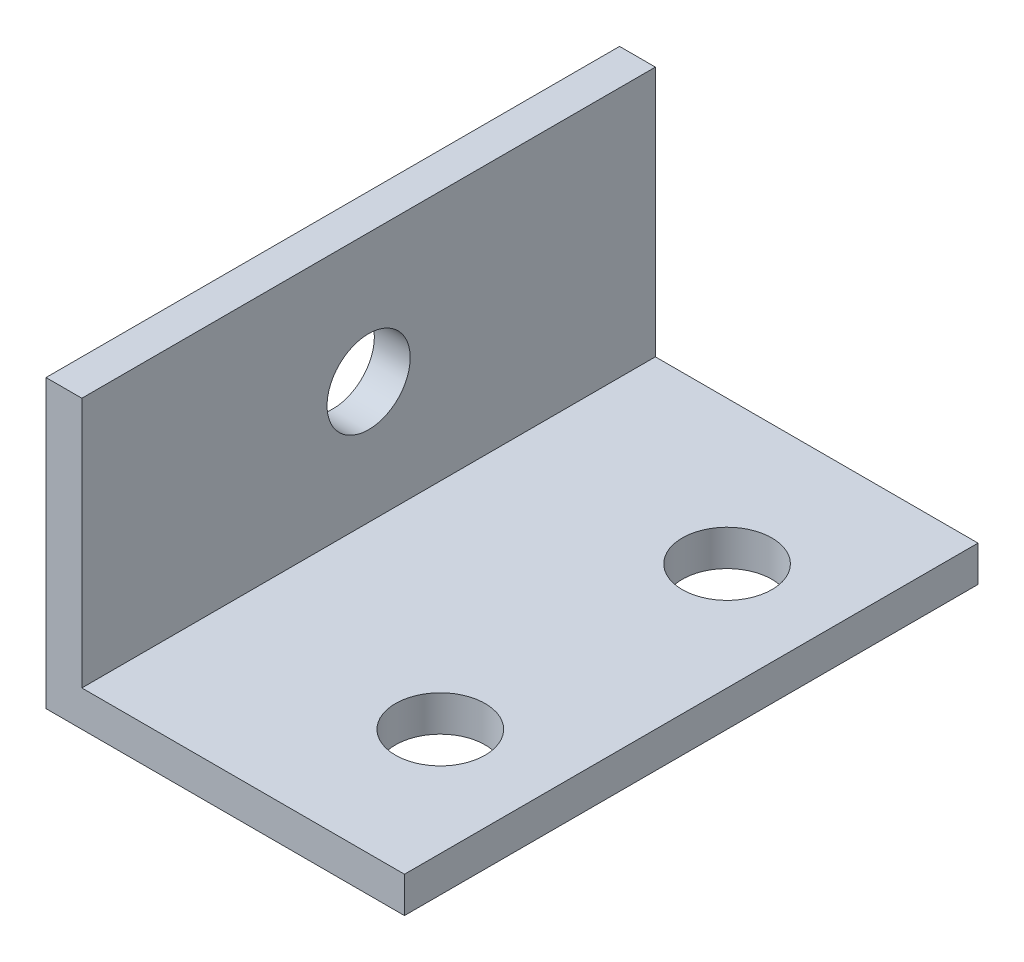
ISO-10303-21;
HEADER;
FILE_DESCRIPTION(('STEP AP214'),'2;1');
FILE_NAME('part.step','',(''),(''),'','','');
FILE_SCHEMA(('AUTOMOTIVE_DESIGN { 1 0 10303 214 1 1 1 1 }'));
ENDSEC;
DATA;
#1=APPLICATION_CONTEXT('core data for automotive mechanical design processes');
#2=APPLICATION_PROTOCOL_DEFINITION('international standard','automotive_design',2000,#1);
#3=PRODUCT_CONTEXT('',#1,'mechanical');
#4=PRODUCT('Part','Part','',(#3));
#5=PRODUCT_RELATED_PRODUCT_CATEGORY('part','',(#4));
#6=PRODUCT_DEFINITION_FORMATION('','',#4);
#7=PRODUCT_DEFINITION_CONTEXT('part definition',#1,'design');
#8=PRODUCT_DEFINITION('design','',#6,#7);
#9=PRODUCT_DEFINITION_SHAPE('','',#8);
#10=(LENGTH_UNIT() NAMED_UNIT(*) SI_UNIT(.MILLI.,.METRE.));
#11=(NAMED_UNIT(*) PLANE_ANGLE_UNIT() SI_UNIT($,.RADIAN.));
#12=(NAMED_UNIT(*) SI_UNIT($,.STERADIAN.) SOLID_ANGLE_UNIT());
#13=UNCERTAINTY_MEASURE_WITH_UNIT(LENGTH_MEASURE(1.E-05),#10,'distance_accuracy_value','');
#14=(GEOMETRIC_REPRESENTATION_CONTEXT(3) GLOBAL_UNCERTAINTY_ASSIGNED_CONTEXT((#13)) GLOBAL_UNIT_ASSIGNED_CONTEXT((#10,
#11,#12)) REPRESENTATION_CONTEXT('',''));
#15=CARTESIAN_POINT('',(0.,0.,0.));
#16=DIRECTION('',(0.,0.,1.));
#17=DIRECTION('',(1.,0.,0.));
#18=AXIS2_PLACEMENT_3D('',#15,#16,#17);
#19=CARTESIAN_POINT('',(0.,0.,50.8));
#20=DIRECTION('',(0.,1.,0.));
#21=DIRECTION('',(0.,0.,1.));
#22=AXIS2_PLACEMENT_3D('',#19,#20,#21);
#23=PLANE('',#22);
#24=CARTESIAN_POINT('',(22.225,0.,12.7));
#25=DIRECTION('',(0.,1.,0.));
#26=DIRECTION('',(0.,0.,1.));
#27=AXIS2_PLACEMENT_3D('',#24,#25,#26);
#28=CIRCLE('',#27,3.96875);
#29=CARTESIAN_POINT('',(22.225,0.,16.66875));
#30=VERTEX_POINT('',#29);
#31=EDGE_CURVE('E164',#30,#30,#28,.F.);
#32=ORIENTED_EDGE('',*,*,#31,.F.);
#33=EDGE_LOOP('',(#32));
#34=FACE_BOUND('',#33,.T.);
#35=CARTESIAN_POINT('',(22.225,0.,38.1));
#36=DIRECTION('',(0.,1.,0.));
#37=DIRECTION('',(0.,0.,1.));
#38=AXIS2_PLACEMENT_3D('',#35,#36,#37);
#39=CIRCLE('',#38,3.96875000000001);
#40=CARTESIAN_POINT('',(22.225,0.,42.06875));
#41=VERTEX_POINT('',#40);
#42=EDGE_CURVE('E167',#41,#41,#39,.F.);
#43=ORIENTED_EDGE('',*,*,#42,.F.);
#44=EDGE_LOOP('',(#43));
#45=FACE_BOUND('',#44,.T.);
#46=DIRECTION('',(1.,0.,0.));
#47=VECTOR('',#46,1.);
#48=CARTESIAN_POINT('',(0.,0.,0.));
#49=LINE('',#48,#47);
#50=CARTESIAN_POINT('',(0.,0.,0.));
#51=VERTEX_POINT('',#50);
#52=CARTESIAN_POINT('',(31.75,0.,0.));
#53=VERTEX_POINT('',#52);
#54=EDGE_CURVE('E119',#51,#53,#49,.T.);
#55=ORIENTED_EDGE('',*,*,#54,.T.);
#56=DIRECTION('',(0.,0.,-1.));
#57=VECTOR('',#56,1.);
#58=CARTESIAN_POINT('',(31.75,0.,50.8));
#59=LINE('',#58,#57);
#60=CARTESIAN_POINT('',(31.75,0.,50.8));
#61=VERTEX_POINT('',#60);
#62=EDGE_CURVE('E11',#61,#53,#59,.T.);
#63=ORIENTED_EDGE('',*,*,#62,.F.);
#64=DIRECTION('',(1.,0.,0.));
#65=VECTOR('',#64,1.);
#66=CARTESIAN_POINT('',(0.,0.,50.8));
#67=LINE('',#66,#65);
#68=CARTESIAN_POINT('',(0.,0.,50.8));
#69=VERTEX_POINT('',#68);
#70=EDGE_CURVE('E134',#69,#61,#67,.T.);
#71=ORIENTED_EDGE('',*,*,#70,.F.);
#72=DIRECTION('',(0.,0.,-1.));
#73=VECTOR('',#72,1.);
#74=CARTESIAN_POINT('',(0.,0.,50.8));
#75=LINE('',#74,#73);
#76=EDGE_CURVE('E51',#69,#51,#75,.T.);
#77=ORIENTED_EDGE('',*,*,#76,.T.);
#78=EDGE_LOOP('',(#55,#63,#71,#77));
#79=FACE_BOUND('',#78,.T.);
#80=ADVANCED_FACE('F35',(#34,#45,#79),#23,.F.);
#81=CARTESIAN_POINT('',(31.75,0.,50.8));
#82=DIRECTION('',(-1.,0.,0.));
#83=DIRECTION('',(0.,0.,1.));
#84=AXIS2_PLACEMENT_3D('',#81,#82,#83);
#85=PLANE('',#84);
#86=DIRECTION('',(0.,1.,0.));
#87=VECTOR('',#86,1.);
#88=CARTESIAN_POINT('',(31.75,0.,0.));
#89=LINE('',#88,#87);
#90=CARTESIAN_POINT('',(31.75,3.175,0.));
#91=VERTEX_POINT('',#90);
#92=EDGE_CURVE('E121',#53,#91,#89,.T.);
#93=ORIENTED_EDGE('',*,*,#92,.T.);
#94=DIRECTION('',(0.,0.,-1.));
#95=VECTOR('',#94,1.);
#96=CARTESIAN_POINT('',(31.75,3.175,50.8));
#97=LINE('',#96,#95);
#98=CARTESIAN_POINT('',(31.75,3.175,50.8));
#99=VERTEX_POINT('',#98);
#100=EDGE_CURVE('E43',#99,#91,#97,.T.);
#101=ORIENTED_EDGE('',*,*,#100,.F.);
#102=DIRECTION('',(0.,1.,0.));
#103=VECTOR('',#102,1.);
#104=CARTESIAN_POINT('',(31.75,0.,50.8));
#105=LINE('',#104,#103);
#106=EDGE_CURVE('E83',#61,#99,#105,.T.);
#107=ORIENTED_EDGE('',*,*,#106,.F.);
#108=ORIENTED_EDGE('',*,*,#62,.T.);
#109=EDGE_LOOP('',(#93,#101,#107,#108));
#110=FACE_BOUND('',#109,.T.);
#111=ADVANCED_FACE('F140',(#110),#85,.F.);
#112=CARTESIAN_POINT('',(0.,3.175,50.8));
#113=DIRECTION('',(0.,1.,0.));
#114=DIRECTION('',(0.,0.,1.));
#115=AXIS2_PLACEMENT_3D('',#112,#113,#114);
#116=PLANE('',#115);
#117=CARTESIAN_POINT('',(22.225,3.175,12.7));
#118=DIRECTION('',(0.,1.,0.));
#119=DIRECTION('',(0.,0.,1.));
#120=AXIS2_PLACEMENT_3D('',#117,#118,#119);
#121=CIRCLE('',#120,3.96875);
#122=CARTESIAN_POINT('',(22.225,3.175,16.66875));
#123=VERTEX_POINT('',#122);
#124=EDGE_CURVE('E180',#123,#123,#121,.T.);
#125=ORIENTED_EDGE('',*,*,#124,.F.);
#126=EDGE_LOOP('',(#125));
#127=FACE_BOUND('',#126,.T.);
#128=CARTESIAN_POINT('',(22.225,3.175,38.1));
#129=DIRECTION('',(0.,1.,0.));
#130=DIRECTION('',(0.,0.,1.));
#131=AXIS2_PLACEMENT_3D('',#128,#129,#130);
#132=CIRCLE('',#131,3.96875000000001);
#133=CARTESIAN_POINT('',(22.225,3.175,42.06875));
#134=VERTEX_POINT('',#133);
#135=EDGE_CURVE('E176',#134,#134,#132,.T.);
#136=ORIENTED_EDGE('',*,*,#135,.F.);
#137=EDGE_LOOP('',(#136));
#138=FACE_BOUND('',#137,.T.);
#139=DIRECTION('',(1.,0.,0.));
#140=VECTOR('',#139,1.);
#141=CARTESIAN_POINT('',(0.,3.175,0.));
#142=LINE('',#141,#140);
#143=CARTESIAN_POINT('',(3.175,3.175,0.));
#144=VERTEX_POINT('',#143);
#145=EDGE_CURVE('E125',#144,#91,#142,.T.);
#146=ORIENTED_EDGE('',*,*,#145,.F.);
#147=DIRECTION('',(0.,0.,-1.));
#148=VECTOR('',#147,1.);
#149=CARTESIAN_POINT('',(3.175,3.175,50.8));
#150=LINE('',#149,#148);
#151=CARTESIAN_POINT('',(3.175,3.175,50.8));
#152=VERTEX_POINT('',#151);
#153=EDGE_CURVE('E111',#152,#144,#150,.T.);
#154=ORIENTED_EDGE('',*,*,#153,.F.);
#155=DIRECTION('',(1.,0.,0.));
#156=VECTOR('',#155,1.);
#157=CARTESIAN_POINT('',(0.,3.175,50.8));
#158=LINE('',#157,#156);
#159=EDGE_CURVE('E101',#152,#99,#158,.T.);
#160=ORIENTED_EDGE('',*,*,#159,.T.);
#161=ORIENTED_EDGE('',*,*,#100,.T.);
#162=EDGE_LOOP('',(#146,#154,#160,#161));
#163=FACE_BOUND('',#162,.T.);
#164=ADVANCED_FACE('F139',(#127,#138,#163),#116,.T.);
#165=CARTESIAN_POINT('',(3.175,0.,50.8));
#166=DIRECTION('',(-1.,0.,0.));
#167=DIRECTION('',(0.,0.,1.));
#168=AXIS2_PLACEMENT_3D('',#165,#166,#167);
#169=PLANE('',#168);
#170=CARTESIAN_POINT('',(3.175,13.97,25.4));
#171=DIRECTION('',(1.,0.,0.));
#172=DIRECTION('',(0.,0.,-1.));
#173=AXIS2_PLACEMENT_3D('',#170,#171,#172);
#174=CIRCLE('',#173,3.683);
#175=CARTESIAN_POINT('',(3.175,13.97,21.717));
#176=VERTEX_POINT('',#175);
#177=EDGE_CURVE('E122',#176,#176,#174,.T.);
#178=ORIENTED_EDGE('',*,*,#177,.F.);
#179=EDGE_LOOP('',(#178));
#180=FACE_BOUND('',#179,.T.);
#181=DIRECTION('',(0.,1.,0.));
#182=VECTOR('',#181,1.);
#183=CARTESIAN_POINT('',(3.175,0.,0.));
#184=LINE('',#183,#182);
#185=CARTESIAN_POINT('',(3.175,25.4,0.));
#186=VERTEX_POINT('',#185);
#187=EDGE_CURVE('E108',#144,#186,#184,.T.);
#188=ORIENTED_EDGE('',*,*,#187,.T.);
#189=DIRECTION('',(0.,0.,-1.));
#190=VECTOR('',#189,1.);
#191=CARTESIAN_POINT('',(3.175,25.4,50.8));
#192=LINE('',#191,#190);
#193=CARTESIAN_POINT('',(3.175,25.4,50.8));
#194=VERTEX_POINT('',#193);
#195=EDGE_CURVE('E105',#194,#186,#192,.T.);
#196=ORIENTED_EDGE('',*,*,#195,.F.);
#197=DIRECTION('',(0.,1.,0.));
#198=VECTOR('',#197,1.);
#199=CARTESIAN_POINT('',(3.175,0.,50.8));
#200=LINE('',#199,#198);
#201=EDGE_CURVE('E94',#152,#194,#200,.T.);
#202=ORIENTED_EDGE('',*,*,#201,.F.);
#203=ORIENTED_EDGE('',*,*,#153,.T.);
#204=EDGE_LOOP('',(#188,#196,#202,#203));
#205=FACE_BOUND('',#204,.T.);
#206=ADVANCED_FACE('F106',(#180,#205),#169,.F.);
#207=CARTESIAN_POINT('',(0.,25.4,50.8));
#208=DIRECTION('',(0.,1.,0.));
#209=DIRECTION('',(0.,0.,1.));
#210=AXIS2_PLACEMENT_3D('',#207,#208,#209);
#211=PLANE('',#210);
#212=DIRECTION('',(1.,0.,0.));
#213=VECTOR('',#212,1.);
#214=CARTESIAN_POINT('',(0.,25.4,0.));
#215=LINE('',#214,#213);
#216=CARTESIAN_POINT('',(0.,25.4,0.));
#217=VERTEX_POINT('',#216);
#218=EDGE_CURVE('E129',#217,#186,#215,.T.);
#219=ORIENTED_EDGE('',*,*,#218,.F.);
#220=DIRECTION('',(0.,0.,-1.));
#221=VECTOR('',#220,1.);
#222=CARTESIAN_POINT('',(0.,25.4,50.8));
#223=LINE('',#222,#221);
#224=CARTESIAN_POINT('',(0.,25.4,50.8));
#225=VERTEX_POINT('',#224);
#226=EDGE_CURVE('E71',#225,#217,#223,.T.);
#227=ORIENTED_EDGE('',*,*,#226,.F.);
#228=DIRECTION('',(1.,0.,0.));
#229=VECTOR('',#228,1.);
#230=CARTESIAN_POINT('',(0.,25.4,50.8));
#231=LINE('',#230,#229);
#232=EDGE_CURVE('E99',#225,#194,#231,.T.);
#233=ORIENTED_EDGE('',*,*,#232,.T.);
#234=ORIENTED_EDGE('',*,*,#195,.T.);
#235=EDGE_LOOP('',(#219,#227,#233,#234));
#236=FACE_BOUND('',#235,.T.);
#237=ADVANCED_FACE('F113',(#236),#211,.T.);
#238=CARTESIAN_POINT('',(0.,0.,50.8));
#239=DIRECTION('',(-1.,0.,0.));
#240=DIRECTION('',(0.,0.,1.));
#241=AXIS2_PLACEMENT_3D('',#238,#239,#240);
#242=PLANE('',#241);
#243=CARTESIAN_POINT('',(0.,13.97,25.4));
#244=DIRECTION('',(-1.,0.,0.));
#245=DIRECTION('',(0.,0.,1.));
#246=AXIS2_PLACEMENT_3D('',#243,#244,#245);
#247=CIRCLE('',#246,3.683);
#248=CARTESIAN_POINT('',(0.,13.97,29.083));
#249=VERTEX_POINT('',#248);
#250=EDGE_CURVE('E171',#249,#249,#247,.F.);
#251=ORIENTED_EDGE('',*,*,#250,.T.);
#252=EDGE_LOOP('',(#251));
#253=FACE_BOUND('',#252,.T.);
#254=DIRECTION('',(0.,1.,0.));
#255=VECTOR('',#254,1.);
#256=CARTESIAN_POINT('',(0.,0.,0.));
#257=LINE('',#256,#255);
#258=EDGE_CURVE('E131',#51,#217,#257,.T.);
#259=ORIENTED_EDGE('',*,*,#258,.F.);
#260=ORIENTED_EDGE('',*,*,#76,.F.);
#261=DIRECTION('',(0.,1.,0.));
#262=VECTOR('',#261,1.);
#263=CARTESIAN_POINT('',(0.,0.,50.8));
#264=LINE('',#263,#262);
#265=EDGE_CURVE('E114',#69,#225,#264,.T.);
#266=ORIENTED_EDGE('',*,*,#265,.T.);
#267=ORIENTED_EDGE('',*,*,#226,.T.);
#268=EDGE_LOOP('',(#259,#260,#266,#267));
#269=FACE_BOUND('',#268,.T.);
#270=ADVANCED_FACE('F144',(#253,#269),#242,.T.);
#271=CARTESIAN_POINT('',(0.,0.,50.8));
#272=DIRECTION('',(0.,0.,1.));
#273=DIRECTION('',(1.,0.,0.));
#274=AXIS2_PLACEMENT_3D('',#271,#272,#273);
#275=PLANE('',#274);
#276=ORIENTED_EDGE('',*,*,#70,.T.);
#277=ORIENTED_EDGE('',*,*,#106,.T.);
#278=ORIENTED_EDGE('',*,*,#159,.F.);
#279=ORIENTED_EDGE('',*,*,#201,.T.);
#280=ORIENTED_EDGE('',*,*,#232,.F.);
#281=ORIENTED_EDGE('',*,*,#265,.F.);
#282=EDGE_LOOP('',(#276,#277,#278,#279,#280,#281));
#283=FACE_BOUND('',#282,.T.);
#284=ADVANCED_FACE('F96',(#283),#275,.T.);
#285=CARTESIAN_POINT('',(0.,0.,0.));
#286=DIRECTION('',(0.,0.,1.));
#287=DIRECTION('',(1.,0.,0.));
#288=AXIS2_PLACEMENT_3D('',#285,#286,#287);
#289=PLANE('',#288);
#290=ORIENTED_EDGE('',*,*,#54,.F.);
#291=ORIENTED_EDGE('',*,*,#258,.T.);
#292=ORIENTED_EDGE('',*,*,#218,.T.);
#293=ORIENTED_EDGE('',*,*,#187,.F.);
#294=ORIENTED_EDGE('',*,*,#145,.T.);
#295=ORIENTED_EDGE('',*,*,#92,.F.);
#296=EDGE_LOOP('',(#290,#291,#292,#293,#294,#295));
#297=FACE_BOUND('',#296,.T.);
#298=ADVANCED_FACE('F143',(#297),#289,.F.);
#299=CARTESIAN_POINT('',(-0.00100000000000013,13.97,25.4));
#300=DIRECTION('',(1.,0.,0.));
#301=DIRECTION('',(0.,0.,-1.));
#302=AXIS2_PLACEMENT_3D('',#299,#300,#301);
#303=CYLINDRICAL_SURFACE('',#302,3.683);
#304=ORIENTED_EDGE('',*,*,#250,.F.);
#305=EDGE_LOOP('',(#304));
#306=FACE_BOUND('',#305,.T.);
#307=ORIENTED_EDGE('',*,*,#177,.T.);
#308=EDGE_LOOP('',(#307));
#309=FACE_BOUND('',#308,.T.);
#310=ADVANCED_FACE('F195',(#306,#309),#303,.F.);
#311=CARTESIAN_POINT('',(22.225,-0.00100000000000013,38.1));
#312=DIRECTION('',(0.,1.,0.));
#313=DIRECTION('',(0.,0.,1.));
#314=AXIS2_PLACEMENT_3D('',#311,#312,#313);
#315=CYLINDRICAL_SURFACE('',#314,3.96875000000001);
#316=ORIENTED_EDGE('',*,*,#135,.T.);
#317=EDGE_LOOP('',(#316));
#318=FACE_BOUND('',#317,.T.);
#319=ORIENTED_EDGE('',*,*,#42,.T.);
#320=EDGE_LOOP('',(#319));
#321=FACE_BOUND('',#320,.T.);
#322=ADVANCED_FACE('F192',(#318,#321),#315,.F.);
#323=CARTESIAN_POINT('',(22.225,-0.00100000000000013,12.7));
#324=DIRECTION('',(0.,1.,0.));
#325=DIRECTION('',(0.,0.,1.));
#326=AXIS2_PLACEMENT_3D('',#323,#324,#325);
#327=CYLINDRICAL_SURFACE('',#326,3.96875);
#328=ORIENTED_EDGE('',*,*,#124,.T.);
#329=EDGE_LOOP('',(#328));
#330=FACE_BOUND('',#329,.T.);
#331=ORIENTED_EDGE('',*,*,#31,.T.);
#332=EDGE_LOOP('',(#331));
#333=FACE_BOUND('',#332,.T.);
#334=ADVANCED_FACE('F184',(#330,#333),#327,.F.);
#335=CLOSED_SHELL('',(#80,#111,#164,#206,#237,#270,#284,#298,#310,#322,#334));
#336=MANIFOLD_SOLID_BREP('B2',#335);
#337=ADVANCED_BREP_SHAPE_REPRESENTATION('',(#18,#336),#14);
#338=SHAPE_DEFINITION_REPRESENTATION(#9,#337);
ENDSEC;
END-ISO-10303-21;
